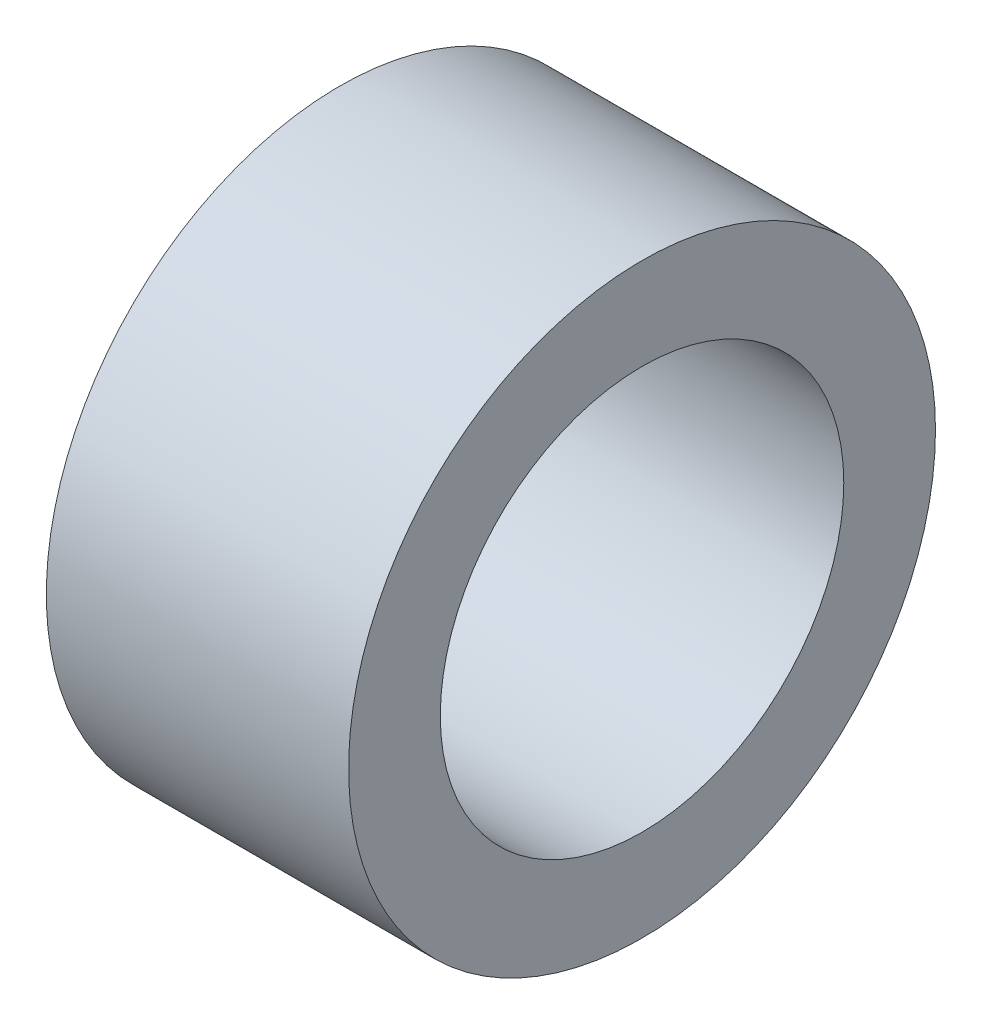
ISO-10303-21;
HEADER;
FILE_DESCRIPTION(('STEP AP214'),'2;1');
FILE_NAME('part.step','',(''),(''),'','','');
FILE_SCHEMA(('AUTOMOTIVE_DESIGN { 1 0 10303 214 1 1 1 1 }'));
ENDSEC;
DATA;
#1=APPLICATION_CONTEXT('core data for automotive mechanical design processes');
#2=APPLICATION_PROTOCOL_DEFINITION('international standard','automotive_design',2000,#1);
#3=PRODUCT_CONTEXT('',#1,'mechanical');
#4=PRODUCT('Part','Part','',(#3));
#5=PRODUCT_RELATED_PRODUCT_CATEGORY('part','',(#4));
#6=PRODUCT_DEFINITION_FORMATION('','',#4);
#7=PRODUCT_DEFINITION_CONTEXT('part definition',#1,'design');
#8=PRODUCT_DEFINITION('design','',#6,#7);
#9=PRODUCT_DEFINITION_SHAPE('','',#8);
#10=(LENGTH_UNIT() NAMED_UNIT(*) SI_UNIT(.MILLI.,.METRE.));
#11=(NAMED_UNIT(*) PLANE_ANGLE_UNIT() SI_UNIT($,.RADIAN.));
#12=(NAMED_UNIT(*) SI_UNIT($,.STERADIAN.) SOLID_ANGLE_UNIT());
#13=UNCERTAINTY_MEASURE_WITH_UNIT(LENGTH_MEASURE(1.E-05),#10,'distance_accuracy_value','');
#14=(GEOMETRIC_REPRESENTATION_CONTEXT(3) GLOBAL_UNCERTAINTY_ASSIGNED_CONTEXT((#13)) GLOBAL_UNIT_ASSIGNED_CONTEXT((#10,
#11,#12)) REPRESENTATION_CONTEXT('',''));
#15=CARTESIAN_POINT('',(0.,0.,0.));
#16=DIRECTION('',(0.,0.,1.));
#17=DIRECTION('',(1.,0.,0.));
#18=AXIS2_PLACEMENT_3D('',#15,#16,#17);
#19=CARTESIAN_POINT('',(6.18,0.,0.));
#20=DIRECTION('',(1.,0.,0.));
#21=DIRECTION('',(0.,0.,-1.));
#22=AXIS2_PLACEMENT_3D('',#19,#20,#21);
#23=PLANE('',#22);
#24=CARTESIAN_POINT('',(6.18,0.,0.));
#25=DIRECTION('',(1.,0.,0.));
#26=DIRECTION('',(0.,0.,-1.));
#27=AXIS2_PLACEMENT_3D('',#24,#25,#26);
#28=CIRCLE('',#27,6.);
#29=CARTESIAN_POINT('',(6.18,0.,-6.));
#30=VERTEX_POINT('',#29);
#31=EDGE_CURVE('E10',#30,#30,#28,.T.);
#32=ORIENTED_EDGE('',*,*,#31,.T.);
#33=EDGE_LOOP('',(#32));
#34=FACE_BOUND('',#33,.T.);
#35=CARTESIAN_POINT('',(6.18,0.,0.));
#36=DIRECTION('',(1.,0.,0.));
#37=DIRECTION('',(0.,0.,-1.));
#38=AXIS2_PLACEMENT_3D('',#35,#36,#37);
#39=CIRCLE('',#38,4.125);
#40=CARTESIAN_POINT('',(6.18,0.,-4.125));
#41=VERTEX_POINT('',#40);
#42=EDGE_CURVE('E48',#41,#41,#39,.T.);
#43=ORIENTED_EDGE('',*,*,#42,.F.);
#44=EDGE_LOOP('',(#43));
#45=FACE_BOUND('',#44,.T.);
#46=ADVANCED_FACE('F37',(#34,#45),#23,.T.);
#47=CARTESIAN_POINT('',(0.,0.,0.));
#48=DIRECTION('',(1.,0.,0.));
#49=DIRECTION('',(0.,0.,-1.));
#50=AXIS2_PLACEMENT_3D('',#47,#48,#49);
#51=PLANE('',#50);
#52=CARTESIAN_POINT('',(0.,0.,0.));
#53=DIRECTION('',(1.,0.,0.));
#54=DIRECTION('',(0.,0.,-1.));
#55=AXIS2_PLACEMENT_3D('',#52,#53,#54);
#56=CIRCLE('',#55,6.);
#57=CARTESIAN_POINT('',(0.,0.,-6.));
#58=VERTEX_POINT('',#57);
#59=EDGE_CURVE('E41',#58,#58,#56,.T.);
#60=ORIENTED_EDGE('',*,*,#59,.F.);
#61=EDGE_LOOP('',(#60));
#62=FACE_BOUND('',#61,.T.);
#63=CARTESIAN_POINT('',(0.,0.,0.));
#64=DIRECTION('',(1.,0.,0.));
#65=DIRECTION('',(0.,0.,-1.));
#66=AXIS2_PLACEMENT_3D('',#63,#64,#65);
#67=CIRCLE('',#66,4.125);
#68=CARTESIAN_POINT('',(0.,0.,-4.125));
#69=VERTEX_POINT('',#68);
#70=EDGE_CURVE('E50',#69,#69,#67,.T.);
#71=ORIENTED_EDGE('',*,*,#70,.T.);
#72=EDGE_LOOP('',(#71));
#73=FACE_BOUND('',#72,.T.);
#74=ADVANCED_FACE('F60',(#62,#73),#51,.F.);
#75=CARTESIAN_POINT('',(6.18,0.,0.));
#76=DIRECTION('',(-1.,0.,0.));
#77=DIRECTION('',(0.,0.,1.));
#78=AXIS2_PLACEMENT_3D('',#75,#76,#77);
#79=CYLINDRICAL_SURFACE('',#78,6.);
#80=ORIENTED_EDGE('',*,*,#31,.F.);
#81=EDGE_LOOP('',(#80));
#82=FACE_BOUND('',#81,.T.);
#83=ORIENTED_EDGE('',*,*,#59,.T.);
#84=EDGE_LOOP('',(#83));
#85=FACE_BOUND('',#84,.T.);
#86=ADVANCED_FACE('F39',(#82,#85),#79,.T.);
#87=CARTESIAN_POINT('',(6.18,0.,0.));
#88=DIRECTION('',(-1.,0.,0.));
#89=DIRECTION('',(0.,0.,1.));
#90=AXIS2_PLACEMENT_3D('',#87,#88,#89);
#91=CYLINDRICAL_SURFACE('',#90,4.125);
#92=ORIENTED_EDGE('',*,*,#42,.T.);
#93=EDGE_LOOP('',(#92));
#94=FACE_BOUND('',#93,.T.);
#95=ORIENTED_EDGE('',*,*,#70,.F.);
#96=EDGE_LOOP('',(#95));
#97=FACE_BOUND('',#96,.T.);
#98=ADVANCED_FACE('F56',(#94,#97),#91,.F.);
#99=CLOSED_SHELL('',(#46,#74,#86,#98));
#100=MANIFOLD_SOLID_BREP('B2',#99);
#101=ADVANCED_BREP_SHAPE_REPRESENTATION('',(#18,#100),#14);
#102=SHAPE_DEFINITION_REPRESENTATION(#9,#101);
ENDSEC;
END-ISO-10303-21;
